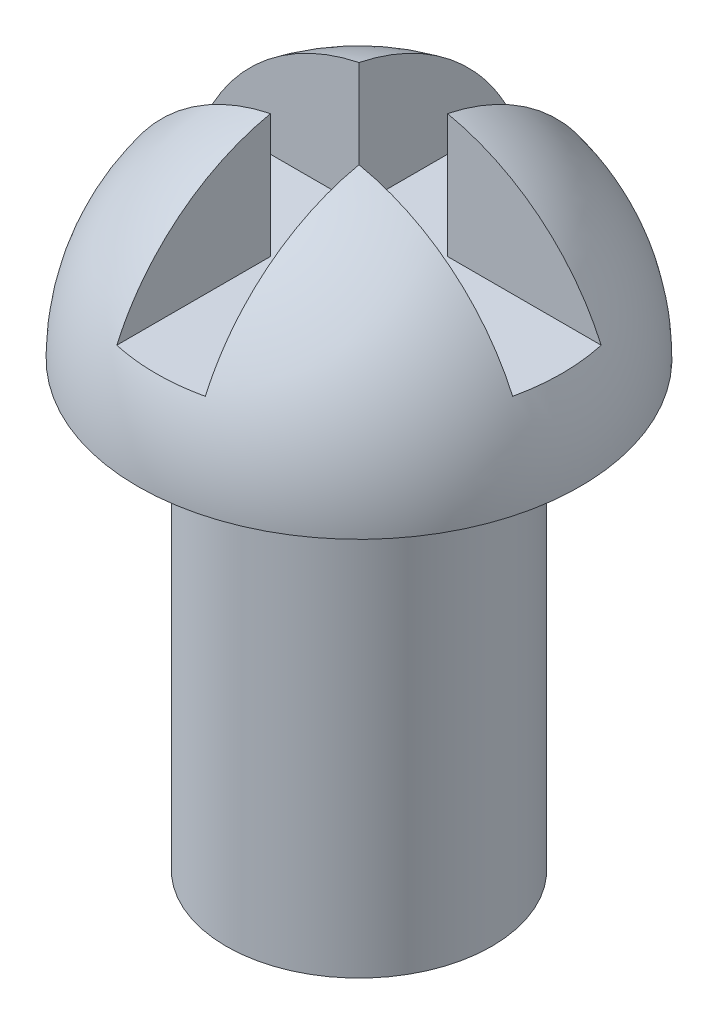
ISO-10303-21;
HEADER;
FILE_DESCRIPTION(('STEP AP214'),'2;1');
FILE_NAME('part.step','',(''),(''),'','','');
FILE_SCHEMA(('AUTOMOTIVE_DESIGN { 1 0 10303 214 1 1 1 1 }'));
ENDSEC;
DATA;
#1=APPLICATION_CONTEXT('core data for automotive mechanical design processes');
#2=APPLICATION_PROTOCOL_DEFINITION('international standard','automotive_design',2000,#1);
#3=PRODUCT_CONTEXT('',#1,'mechanical');
#4=PRODUCT('Part','Part','',(#3));
#5=PRODUCT_RELATED_PRODUCT_CATEGORY('part','',(#4));
#6=PRODUCT_DEFINITION_FORMATION('','',#4);
#7=PRODUCT_DEFINITION_CONTEXT('part definition',#1,'design');
#8=PRODUCT_DEFINITION('design','',#6,#7);
#9=PRODUCT_DEFINITION_SHAPE('','',#8);
#10=(LENGTH_UNIT() NAMED_UNIT(*) SI_UNIT(.MILLI.,.METRE.));
#11=(NAMED_UNIT(*) PLANE_ANGLE_UNIT() SI_UNIT($,.RADIAN.));
#12=(NAMED_UNIT(*) SI_UNIT($,.STERADIAN.) SOLID_ANGLE_UNIT());
#13=UNCERTAINTY_MEASURE_WITH_UNIT(LENGTH_MEASURE(1.E-05),#10,'distance_accuracy_value','');
#14=(GEOMETRIC_REPRESENTATION_CONTEXT(3) GLOBAL_UNCERTAINTY_ASSIGNED_CONTEXT((#13)) GLOBAL_UNIT_ASSIGNED_CONTEXT((#10,
#11,#12)) REPRESENTATION_CONTEXT('',''));
#15=CARTESIAN_POINT('',(0.,0.,0.));
#16=DIRECTION('',(0.,0.,1.));
#17=DIRECTION('',(1.,0.,0.));
#18=AXIS2_PLACEMENT_3D('',#15,#16,#17);
#19=CARTESIAN_POINT('',(0.,5.,0.));
#20=DIRECTION('',(0.,-1.,0.));
#21=DIRECTION('',(0.,0.,-1.));
#22=AXIS2_PLACEMENT_3D('',#19,#20,#21);
#23=CYLINDRICAL_SURFACE('',#22,1.5);
#24=CARTESIAN_POINT('',(0.,5.,0.));
#25=DIRECTION('',(0.,1.,0.));
#26=DIRECTION('',(0.,0.,1.));
#27=AXIS2_PLACEMENT_3D('',#24,#25,#26);
#28=CIRCLE('',#27,1.5);
#29=CARTESIAN_POINT('',(0.,5.,1.5));
#30=VERTEX_POINT('',#29);
#31=EDGE_CURVE('E143',#30,#30,#28,.T.);
#32=ORIENTED_EDGE('',*,*,#31,.F.);
#33=EDGE_LOOP('',(#32));
#34=FACE_BOUND('',#33,.T.);
#35=CARTESIAN_POINT('',(0.,0.,0.));
#36=DIRECTION('',(0.,1.,0.));
#37=DIRECTION('',(0.,0.,1.));
#38=AXIS2_PLACEMENT_3D('',#35,#36,#37);
#39=CIRCLE('',#38,1.5);
#40=CARTESIAN_POINT('',(0.,0.,1.5));
#41=VERTEX_POINT('',#40);
#42=EDGE_CURVE('E142',#41,#41,#39,.T.);
#43=ORIENTED_EDGE('',*,*,#42,.T.);
#44=EDGE_LOOP('',(#43));
#45=FACE_BOUND('',#44,.T.);
#46=ADVANCED_FACE('F34',(#34,#45),#23,.T.);
#47=CARTESIAN_POINT('',(0.,0.,0.));
#48=DIRECTION('',(0.,1.,0.));
#49=DIRECTION('',(0.,0.,1.));
#50=AXIS2_PLACEMENT_3D('',#47,#48,#49);
#51=PLANE('',#50);
#52=ORIENTED_EDGE('',*,*,#42,.F.);
#53=EDGE_LOOP('',(#52));
#54=FACE_BOUND('',#53,.T.);
#55=ADVANCED_FACE('F189',(#54),#51,.F.);
#56=CARTESIAN_POINT('',(0.,5.,0.));
#57=DIRECTION('',(0.,0.,-1.));
#58=DIRECTION('',(-1.,0.,0.));
#59=AXIS2_PLACEMENT_3D('',#56,#57,#58);
#60=SPHERICAL_SURFACE('',#59,2.5);
#61=CARTESIAN_POINT('',(0.,5.,-0.5));
#62=DIRECTION('',(0.,0.,-1.));
#63=DIRECTION('',(-1.,0.,0.));
#64=AXIS2_PLACEMENT_3D('',#61,#62,#63);
#65=CIRCLE('',#64,2.44948974278318);
#66=CARTESIAN_POINT('',(-2.23606797749979,6.,-0.5));
#67=VERTEX_POINT('',#66);
#68=CARTESIAN_POINT('',(-0.5,7.39791576165636,-0.5));
#69=VERTEX_POINT('',#68);
#70=EDGE_CURVE('E41',#67,#69,#65,.T.);
#71=ORIENTED_EDGE('',*,*,#70,.T.);
#72=CARTESIAN_POINT('',(-0.499999999999999,5.,0.));
#73=DIRECTION('',(-1.,0.,0.));
#74=DIRECTION('',(0.,0.,1.));
#75=AXIS2_PLACEMENT_3D('',#72,#73,#74);
#76=CIRCLE('',#75,2.44948974278318);
#77=CARTESIAN_POINT('',(-0.5,6.,-2.23606797749979));
#78=VERTEX_POINT('',#77);
#79=EDGE_CURVE('E11',#69,#78,#76,.T.);
#80=ORIENTED_EDGE('',*,*,#79,.T.);
#81=CARTESIAN_POINT('',(0.,6.,0.));
#82=DIRECTION('',(0.,1.,0.));
#83=DIRECTION('',(0.,0.,1.));
#84=AXIS2_PLACEMENT_3D('',#81,#82,#83);
#85=CIRCLE('',#84,2.29128784747792);
#86=CARTESIAN_POINT('',(0.5,6.,-2.23606797749979));
#87=VERTEX_POINT('',#86);
#88=EDGE_CURVE('E107',#87,#78,#85,.T.);
#89=ORIENTED_EDGE('',*,*,#88,.F.);
#90=CARTESIAN_POINT('',(0.5,5.,0.));
#91=DIRECTION('',(1.,0.,0.));
#92=DIRECTION('',(0.,0.,-1.));
#93=AXIS2_PLACEMENT_3D('',#90,#91,#92);
#94=CIRCLE('',#93,2.44948974278318);
#95=CARTESIAN_POINT('',(0.5,7.39791576165636,-0.5));
#96=VERTEX_POINT('',#95);
#97=EDGE_CURVE('E164',#87,#96,#94,.T.);
#98=ORIENTED_EDGE('',*,*,#97,.T.);
#99=CARTESIAN_POINT('',(0.,5.,-0.5));
#100=DIRECTION('',(0.,0.,-1.));
#101=DIRECTION('',(-1.,0.,0.));
#102=AXIS2_PLACEMENT_3D('',#99,#100,#101);
#103=CIRCLE('',#102,2.44948974278318);
#104=CARTESIAN_POINT('',(2.23606797749979,6.,-0.5));
#105=VERTEX_POINT('',#104);
#106=EDGE_CURVE('E56',#96,#105,#103,.T.);
#107=ORIENTED_EDGE('',*,*,#106,.T.);
#108=CARTESIAN_POINT('',(2.23606797749979,6.,0.5));
#109=VERTEX_POINT('',#108);
#110=EDGE_CURVE('E151',#109,#105,#85,.T.);
#111=ORIENTED_EDGE('',*,*,#110,.F.);
#112=CARTESIAN_POINT('',(0.,5.,0.5));
#113=DIRECTION('',(0.,0.,1.));
#114=DIRECTION('',(1.,0.,0.));
#115=AXIS2_PLACEMENT_3D('',#112,#113,#114);
#116=CIRCLE('',#115,2.44948974278318);
#117=CARTESIAN_POINT('',(0.5,7.39791576165636,0.5));
#118=VERTEX_POINT('',#117);
#119=EDGE_CURVE('E157',#109,#118,#116,.T.);
#120=ORIENTED_EDGE('',*,*,#119,.T.);
#121=CARTESIAN_POINT('',(0.5,5.,0.));
#122=DIRECTION('',(1.,0.,0.));
#123=DIRECTION('',(0.,0.,-1.));
#124=AXIS2_PLACEMENT_3D('',#121,#122,#123);
#125=CIRCLE('',#124,2.44948974278318);
#126=CARTESIAN_POINT('',(0.5,6.,2.23606797749979));
#127=VERTEX_POINT('',#126);
#128=EDGE_CURVE('E154',#118,#127,#125,.T.);
#129=ORIENTED_EDGE('',*,*,#128,.T.);
#130=CARTESIAN_POINT('',(-0.5,6.,2.23606797749979));
#131=VERTEX_POINT('',#130);
#132=EDGE_CURVE('E146',#131,#127,#85,.T.);
#133=ORIENTED_EDGE('',*,*,#132,.F.);
#134=CARTESIAN_POINT('',(-0.5,5.,0.));
#135=DIRECTION('',(-1.,0.,0.));
#136=DIRECTION('',(0.,0.,1.));
#137=AXIS2_PLACEMENT_3D('',#134,#135,#136);
#138=CIRCLE('',#137,2.44948974278318);
#139=CARTESIAN_POINT('',(-0.5,7.39791576165636,0.5));
#140=VERTEX_POINT('',#139);
#141=EDGE_CURVE('E150',#131,#140,#138,.T.);
#142=ORIENTED_EDGE('',*,*,#141,.T.);
#143=CARTESIAN_POINT('',(0.,5.,0.5));
#144=DIRECTION('',(0.,0.,1.));
#145=DIRECTION('',(1.,0.,0.));
#146=AXIS2_PLACEMENT_3D('',#143,#144,#145);
#147=CIRCLE('',#146,2.44948974278318);
#148=CARTESIAN_POINT('',(-2.23606797749979,6.,0.5));
#149=VERTEX_POINT('',#148);
#150=EDGE_CURVE('E160',#140,#149,#147,.T.);
#151=ORIENTED_EDGE('',*,*,#150,.T.);
#152=EDGE_CURVE('E166',#67,#149,#85,.T.);
#153=ORIENTED_EDGE('',*,*,#152,.F.);
#154=EDGE_LOOP('',(#71,#80,#89,#98,#107,#111,#120,#129,#133,#142,#151,#153));
#155=FACE_BOUND('',#154,.T.);
#156=CARTESIAN_POINT('',(0.,5.,0.));
#157=DIRECTION('',(0.,-1.,0.));
#158=DIRECTION('',(0.,0.,1.));
#159=AXIS2_PLACEMENT_3D('',#156,#157,#158);
#160=CIRCLE('',#159,2.5);
#161=CARTESIAN_POINT('',(0.,5.,2.5));
#162=VERTEX_POINT('',#161);
#163=EDGE_CURVE('E134',#162,#162,#160,.T.);
#164=ORIENTED_EDGE('',*,*,#163,.F.);
#165=EDGE_LOOP('',(#164));
#166=FACE_BOUND('',#165,.T.);
#167=ADVANCED_FACE('F173',(#155,#166),#60,.T.);
#168=CARTESIAN_POINT('',(0.,5.,0.));
#169=DIRECTION('',(0.,-1.,0.));
#170=DIRECTION('',(0.,0.,1.));
#171=AXIS2_PLACEMENT_3D('',#168,#169,#170);
#172=PLANE('',#171);
#173=ORIENTED_EDGE('',*,*,#31,.T.);
#174=EDGE_LOOP('',(#173));
#175=FACE_BOUND('',#174,.T.);
#176=ORIENTED_EDGE('',*,*,#163,.T.);
#177=EDGE_LOOP('',(#176));
#178=FACE_BOUND('',#177,.T.);
#179=ADVANCED_FACE('F185',(#175,#178),#172,.T.);
#180=CARTESIAN_POINT('',(-0.500000000000001,6.,-4.67398282875427));
#181=DIRECTION('',(-1.,0.,0.));
#182=DIRECTION('',(0.,0.,1.));
#183=AXIS2_PLACEMENT_3D('',#180,#181,#182);
#184=PLANE('',#183);
#185=DIRECTION('',(0.,1.,0.));
#186=VECTOR('',#185,1.);
#187=CARTESIAN_POINT('',(-0.5,6.,-0.5));
#188=LINE('',#187,#186);
#189=CARTESIAN_POINT('',(-0.5,6.,-0.5));
#190=VERTEX_POINT('',#189);
#191=EDGE_CURVE('E111',#190,#69,#188,.T.);
#192=ORIENTED_EDGE('',*,*,#191,.F.);
#193=DIRECTION('',(0.,0.,1.));
#194=VECTOR('',#193,1.);
#195=CARTESIAN_POINT('',(-0.500000000000001,6.,-4.67398282875427));
#196=LINE('',#195,#194);
#197=EDGE_CURVE('E99',#78,#190,#196,.T.);
#198=ORIENTED_EDGE('',*,*,#197,.F.);
#199=ORIENTED_EDGE('',*,*,#79,.F.);
#200=EDGE_LOOP('',(#192,#198,#199));
#201=FACE_BOUND('',#200,.T.);
#202=ADVANCED_FACE('F112',(#201),#184,.F.);
#203=CARTESIAN_POINT('',(0.499999999999999,6.,-4.67398282875427));
#204=DIRECTION('',(1.,0.,0.));
#205=DIRECTION('',(0.,0.,-1.));
#206=AXIS2_PLACEMENT_3D('',#203,#204,#205);
#207=PLANE('',#206);
#208=DIRECTION('',(0.,0.,-1.));
#209=VECTOR('',#208,1.);
#210=CARTESIAN_POINT('',(0.499999999999999,6.,-4.67398282875427));
#211=LINE('',#210,#209);
#212=CARTESIAN_POINT('',(0.5,6.,-0.5));
#213=VERTEX_POINT('',#212);
#214=EDGE_CURVE('E116',#213,#87,#211,.T.);
#215=ORIENTED_EDGE('',*,*,#214,.F.);
#216=DIRECTION('',(0.,1.,0.));
#217=VECTOR('',#216,1.);
#218=CARTESIAN_POINT('',(0.5,6.,-0.5));
#219=LINE('',#218,#217);
#220=EDGE_CURVE('E132',#213,#96,#219,.T.);
#221=ORIENTED_EDGE('',*,*,#220,.T.);
#222=ORIENTED_EDGE('',*,*,#97,.F.);
#223=EDGE_LOOP('',(#215,#221,#222));
#224=FACE_BOUND('',#223,.T.);
#225=ADVANCED_FACE('F176',(#224),#207,.F.);
#226=CARTESIAN_POINT('',(0.5,6.,-0.5));
#227=DIRECTION('',(0.,0.,-1.));
#228=DIRECTION('',(-1.,0.,0.));
#229=AXIS2_PLACEMENT_3D('',#226,#227,#228);
#230=PLANE('',#229);
#231=ORIENTED_EDGE('',*,*,#220,.F.);
#232=DIRECTION('',(-1.,0.,0.));
#233=VECTOR('',#232,1.);
#234=CARTESIAN_POINT('',(0.5,6.,-0.5));
#235=LINE('',#234,#233);
#236=EDGE_CURVE('E129',#105,#213,#235,.T.);
#237=ORIENTED_EDGE('',*,*,#236,.F.);
#238=ORIENTED_EDGE('',*,*,#106,.F.);
#239=EDGE_LOOP('',(#231,#237,#238));
#240=FACE_BOUND('',#239,.T.);
#241=ADVANCED_FACE('F171',(#240),#230,.F.);
#242=CARTESIAN_POINT('',(0.5,6.,0.5));
#243=DIRECTION('',(0.,0.,1.));
#244=DIRECTION('',(1.,0.,0.));
#245=AXIS2_PLACEMENT_3D('',#242,#243,#244);
#246=PLANE('',#245);
#247=DIRECTION('',(1.,0.,0.));
#248=VECTOR('',#247,1.);
#249=CARTESIAN_POINT('',(0.5,6.,0.5));
#250=LINE('',#249,#248);
#251=CARTESIAN_POINT('',(0.5,6.,0.5));
#252=VERTEX_POINT('',#251);
#253=EDGE_CURVE('E126',#252,#109,#250,.T.);
#254=ORIENTED_EDGE('',*,*,#253,.F.);
#255=DIRECTION('',(0.,1.,0.));
#256=VECTOR('',#255,1.);
#257=CARTESIAN_POINT('',(0.5,6.,0.5));
#258=LINE('',#257,#256);
#259=EDGE_CURVE('E135',#252,#118,#258,.T.);
#260=ORIENTED_EDGE('',*,*,#259,.T.);
#261=ORIENTED_EDGE('',*,*,#119,.F.);
#262=EDGE_LOOP('',(#254,#260,#261));
#263=FACE_BOUND('',#262,.T.);
#264=ADVANCED_FACE('F183',(#263),#246,.F.);
#265=CARTESIAN_POINT('',(0.5,6.,0.5));
#266=DIRECTION('',(1.,0.,0.));
#267=DIRECTION('',(0.,0.,-1.));
#268=AXIS2_PLACEMENT_3D('',#265,#266,#267);
#269=PLANE('',#268);
#270=ORIENTED_EDGE('',*,*,#259,.F.);
#271=DIRECTION('',(0.,0.,-1.));
#272=VECTOR('',#271,1.);
#273=CARTESIAN_POINT('',(0.5,6.,0.5));
#274=LINE('',#273,#272);
#275=EDGE_CURVE('E124',#127,#252,#274,.T.);
#276=ORIENTED_EDGE('',*,*,#275,.F.);
#277=ORIENTED_EDGE('',*,*,#128,.F.);
#278=EDGE_LOOP('',(#270,#276,#277));
#279=FACE_BOUND('',#278,.T.);
#280=ADVANCED_FACE('F217',(#279),#269,.F.);
#281=CARTESIAN_POINT('',(-0.5,6.,0.5));
#282=DIRECTION('',(-1.,0.,0.));
#283=DIRECTION('',(0.,0.,1.));
#284=AXIS2_PLACEMENT_3D('',#281,#282,#283);
#285=PLANE('',#284);
#286=DIRECTION('',(0.,0.,1.));
#287=VECTOR('',#286,1.);
#288=CARTESIAN_POINT('',(-0.5,6.,0.5));
#289=LINE('',#288,#287);
#290=CARTESIAN_POINT('',(-0.5,6.,0.5));
#291=VERTEX_POINT('',#290);
#292=EDGE_CURVE('E48',#291,#131,#289,.T.);
#293=ORIENTED_EDGE('',*,*,#292,.F.);
#294=DIRECTION('',(0.,1.,0.));
#295=VECTOR('',#294,1.);
#296=CARTESIAN_POINT('',(-0.5,6.,0.5));
#297=LINE('',#296,#295);
#298=EDGE_CURVE('E115',#291,#140,#297,.T.);
#299=ORIENTED_EDGE('',*,*,#298,.T.);
#300=ORIENTED_EDGE('',*,*,#141,.F.);
#301=EDGE_LOOP('',(#293,#299,#300));
#302=FACE_BOUND('',#301,.T.);
#303=ADVANCED_FACE('F213',(#302),#285,.F.);
#304=CARTESIAN_POINT('',(-4.83332315246177,6.,0.5));
#305=DIRECTION('',(0.,0.,1.));
#306=DIRECTION('',(1.,0.,0.));
#307=AXIS2_PLACEMENT_3D('',#304,#305,#306);
#308=PLANE('',#307);
#309=ORIENTED_EDGE('',*,*,#298,.F.);
#310=DIRECTION('',(1.,0.,0.));
#311=VECTOR('',#310,1.);
#312=CARTESIAN_POINT('',(-4.83332315246177,6.,0.5));
#313=LINE('',#312,#311);
#314=EDGE_CURVE('E119',#149,#291,#313,.T.);
#315=ORIENTED_EDGE('',*,*,#314,.F.);
#316=ORIENTED_EDGE('',*,*,#150,.F.);
#317=EDGE_LOOP('',(#309,#315,#316));
#318=FACE_BOUND('',#317,.T.);
#319=ADVANCED_FACE('F210',(#318),#308,.F.);
#320=CARTESIAN_POINT('',(-4.83332315246177,6.,-0.5));
#321=DIRECTION('',(0.,0.,-1.));
#322=DIRECTION('',(-1.,0.,0.));
#323=AXIS2_PLACEMENT_3D('',#320,#321,#322);
#324=PLANE('',#323);
#325=DIRECTION('',(-1.,0.,0.));
#326=VECTOR('',#325,1.);
#327=CARTESIAN_POINT('',(-4.83332315246177,6.,-0.5));
#328=LINE('',#327,#326);
#329=EDGE_CURVE('E103',#190,#67,#328,.T.);
#330=ORIENTED_EDGE('',*,*,#329,.F.);
#331=ORIENTED_EDGE('',*,*,#191,.T.);
#332=ORIENTED_EDGE('',*,*,#70,.F.);
#333=EDGE_LOOP('',(#330,#331,#332));
#334=FACE_BOUND('',#333,.T.);
#335=ADVANCED_FACE('F118',(#334),#324,.F.);
#336=CARTESIAN_POINT('',(0.,6.,0.));
#337=DIRECTION('',(0.,1.,0.));
#338=DIRECTION('',(0.,0.,1.));
#339=AXIS2_PLACEMENT_3D('',#336,#337,#338);
#340=PLANE('',#339);
#341=ORIENTED_EDGE('',*,*,#110,.T.);
#342=ORIENTED_EDGE('',*,*,#236,.T.);
#343=ORIENTED_EDGE('',*,*,#214,.T.);
#344=ORIENTED_EDGE('',*,*,#88,.T.);
#345=ORIENTED_EDGE('',*,*,#197,.T.);
#346=ORIENTED_EDGE('',*,*,#329,.T.);
#347=ORIENTED_EDGE('',*,*,#152,.T.);
#348=ORIENTED_EDGE('',*,*,#314,.T.);
#349=ORIENTED_EDGE('',*,*,#292,.T.);
#350=ORIENTED_EDGE('',*,*,#132,.T.);
#351=ORIENTED_EDGE('',*,*,#275,.T.);
#352=ORIENTED_EDGE('',*,*,#253,.T.);
#353=EDGE_LOOP('',(#341,#342,#343,#344,#345,#346,#347,#348,#349,#350,#351,#352));
#354=FACE_BOUND('',#353,.T.);
#355=ADVANCED_FACE('F101',(#354),#340,.T.);
#356=CLOSED_SHELL('',(#46,#55,#167,#179,#202,#225,#241,#264,#280,#303,#319,#335,#355));
#357=MANIFOLD_SOLID_BREP('B2',#356);
#358=ADVANCED_BREP_SHAPE_REPRESENTATION('',(#18,#357),#14);
#359=SHAPE_DEFINITION_REPRESENTATION(#9,#358);
ENDSEC;
END-ISO-10303-21;
